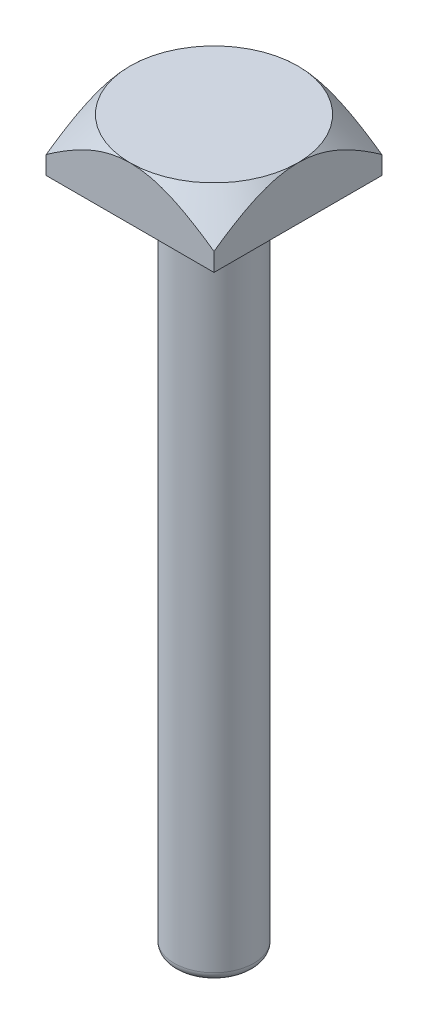
ISO-10303-21;
HEADER;
FILE_DESCRIPTION(('STEP AP214'),'2;1');
FILE_NAME('part.step','',(''),(''),'','','');
FILE_SCHEMA(('AUTOMOTIVE_DESIGN { 1 0 10303 214 1 1 1 1 }'));
ENDSEC;
DATA;
#1=APPLICATION_CONTEXT('core data for automotive mechanical design processes');
#2=APPLICATION_PROTOCOL_DEFINITION('international standard','automotive_design',2000,#1);
#3=PRODUCT_CONTEXT('',#1,'mechanical');
#4=PRODUCT('Part','Part','',(#3));
#5=PRODUCT_RELATED_PRODUCT_CATEGORY('part','',(#4));
#6=PRODUCT_DEFINITION_FORMATION('','',#4);
#7=PRODUCT_DEFINITION_CONTEXT('part definition',#1,'design');
#8=PRODUCT_DEFINITION('design','',#6,#7);
#9=PRODUCT_DEFINITION_SHAPE('','',#8);
#10=(LENGTH_UNIT() NAMED_UNIT(*) SI_UNIT(.MILLI.,.METRE.));
#11=(NAMED_UNIT(*) PLANE_ANGLE_UNIT() SI_UNIT($,.RADIAN.));
#12=(NAMED_UNIT(*) SI_UNIT($,.STERADIAN.) SOLID_ANGLE_UNIT());
#13=UNCERTAINTY_MEASURE_WITH_UNIT(LENGTH_MEASURE(1.E-05),#10,'distance_accuracy_value','');
#14=(GEOMETRIC_REPRESENTATION_CONTEXT(3) GLOBAL_UNCERTAINTY_ASSIGNED_CONTEXT((#13)) GLOBAL_UNIT_ASSIGNED_CONTEXT((#10,
#11,#12)) REPRESENTATION_CONTEXT('',''));
#15=CARTESIAN_POINT('',(0.,0.,0.));
#16=DIRECTION('',(0.,0.,1.));
#17=DIRECTION('',(1.,0.,0.));
#18=AXIS2_PLACEMENT_3D('',#15,#16,#17);
#19=CARTESIAN_POINT('',(14.,6.,-9.5));
#20=DIRECTION('',(-1.,0.,0.));
#21=DIRECTION('',(0.,-1.,0.));
#22=AXIS2_PLACEMENT_3D('',#19,#20,#21);
#23=PLANE('',#22);
#24=CARTESIAN_POINT('',(14.,-6.16599312174739,-19.4721662367495));
#25=CARTESIAN_POINT('',(14.,-5.76924661562535,-19.0306587695027));
#26=CARTESIAN_POINT('',(14.,-5.37387132656418,-18.5879083571048));
#27=CARTESIAN_POINT('',(14.,-4.58658874420138,-17.6992696729411));
#28=CARTESIAN_POINT('',(14.,-4.1946817472815,-17.253381138743));
#29=CARTESIAN_POINT('',(14.,-3.41378811833251,-16.3563487784739));
#30=CARTESIAN_POINT('',(14.,-3.02481616691146,-15.9051921518799));
#31=CARTESIAN_POINT('',(14.,-2.2522618562009,-14.9983091045179));
#32=CARTESIAN_POINT('',(14.,-1.86867929214896,-14.5425828584999));
#33=CARTESIAN_POINT('',(14.,-1.08671046568416,-13.5993558341223));
#34=CARTESIAN_POINT('',(14.,-0.688724142040345,-13.1115228122817));
#35=CARTESIAN_POINT('',(14.,0.0972631598394903,-12.127740391124));
#36=CARTESIAN_POINT('',(14.,0.485262999626204,-11.631790076894));
#37=CARTESIAN_POINT('',(14.,1.05674605712848,-10.8804316855481));
#38=CARTESIAN_POINT('',(14.,1.24535681621388,-10.6289221327915));
#39=CARTESIAN_POINT('',(14.,1.61855164136854,-10.122936754571));
#40=CARTESIAN_POINT('',(14.,1.80313581309921,-9.86846100721232));
#41=CARTESIAN_POINT('',(14.,2.16750299016799,-9.35616816236647));
#42=CARTESIAN_POINT('',(14.,2.34728697505086,-9.09835176278388));
#43=CARTESIAN_POINT('',(14.,2.7011558307242,-8.57884600167523));
#44=CARTESIAN_POINT('',(14.,2.87524104091076,-8.3171568721462));
#45=CARTESIAN_POINT('',(14.,3.17412721280475,-7.85493467103632));
#46=CARTESIAN_POINT('',(14.,3.30042278588939,-7.65536859867558));
#47=CARTESIAN_POINT('',(14.,3.54852838415979,-7.25345964461779));
#48=CARTESIAN_POINT('',(14.,3.67033839375831,-7.05111675327469));
#49=CARTESIAN_POINT('',(14.,3.90880250524161,-6.6432850603803));
#50=CARTESIAN_POINT('',(14.,4.02545427528355,-6.43779489145272));
#51=CARTESIAN_POINT('',(14.,4.25267855562839,-6.02347501374829));
#52=CARTESIAN_POINT('',(14.,4.36325111331347,-5.81464533101642));
#53=CARTESIAN_POINT('',(14.,4.5763702753258,-5.39518549248985));
#54=CARTESIAN_POINT('',(14.,4.67897827231214,-5.18458675025878));
#55=CARTESIAN_POINT('',(14.,4.87604292507633,-4.75961336071198));
#56=CARTESIAN_POINT('',(14.,4.97049886246233,-4.54523838261968));
#57=CARTESIAN_POINT('',(14.,5.23951493786688,-3.89645079968952));
#58=CARTESIAN_POINT('',(14.,5.39996433070188,-3.45591344527138));
#59=CARTESIAN_POINT('',(14.,5.61945387533872,-2.728720561896));
#60=CARTESIAN_POINT('',(14.,5.69391703568907,-2.44669896764991));
#61=CARTESIAN_POINT('',(14.,5.82020550087591,-1.8775836953198));
#62=CARTESIAN_POINT('',(14.,5.87203447212183,-1.59049084655016));
#63=CARTESIAN_POINT('',(14.,5.95031086354017,-1.01382091769355));
#64=CARTESIAN_POINT('',(14.,5.97684468254283,-0.724255727219075));
#65=CARTESIAN_POINT('',(14.,6.00333190102634,-0.143893334609149));
#66=CARTESIAN_POINT('',(14.,6.00328565264763,0.146903851153435));
#67=CARTESIAN_POINT('',(14.,5.97661898826888,0.727182792411846));
#68=CARTESIAN_POINT('',(14.,5.95000522827896,1.01666485913919));
#69=CARTESIAN_POINT('',(14.,5.87172266706753,1.59218947393448));
#70=CARTESIAN_POINT('',(14.,5.82005186094646,1.8782317448955));
#71=CARTESIAN_POINT('',(14.,5.69398182139449,2.44645150674143));
#72=CARTESIAN_POINT('',(14.,5.61948831039046,2.7286077957222));
#73=CARTESIAN_POINT('',(14.,5.45096162167953,3.28695252192376));
#74=CARTESIAN_POINT('',(14.,5.35692802815613,3.56314083200677));
#75=CARTESIAN_POINT('',(14.,5.12846275343973,4.17331443672115));
#76=CARTESIAN_POINT('',(14.,4.98972796682012,4.5056787747822));
#77=CARTESIAN_POINT('',(14.,4.69235694668232,5.16145646270299));
#78=CARTESIAN_POINT('',(14.,4.53371080916181,5.48486525963186));
#79=CARTESIAN_POINT('',(14.,4.20046369348786,6.12405309221409));
#80=CARTESIAN_POINT('',(14.,4.02583374948831,6.43981691033184));
#81=CARTESIAN_POINT('',(14.,3.66419592346179,7.06406092749921));
#82=CARTESIAN_POINT('',(14.,3.47718997307517,7.372542253047));
#83=CARTESIAN_POINT('',(14.,3.0905881318274,7.98758397010631));
#84=CARTESIAN_POINT('',(14.,2.89085164620449,8.29405557605348));
#85=CARTESIAN_POINT('',(14.,2.48322727117937,8.90152034753676));
#86=CARTESIAN_POINT('',(14.,2.27533913546706,9.20251334712844));
#87=CARTESIAN_POINT('',(14.,1.85319842359999,9.79947322763256));
#88=CARTESIAN_POINT('',(14.,1.63895342752225,10.0954454816737));
#89=CARTESIAN_POINT('',(14.,1.31353479882875,10.5363942636256));
#90=CARTESIAN_POINT('',(14.,1.20438826860106,10.6828735892338));
#91=CARTESIAN_POINT('',(14.,0.984861237266858,10.9749043216142));
#92=CARTESIAN_POINT('',(14.,0.874480738781644,11.1204557303566));
#93=CARTESIAN_POINT('',(14.,0.502857829512475,11.6065788078486));
#94=CARTESIAN_POINT('',(14.,0.23908003650954,11.9452145423811));
#95=CARTESIAN_POINT('',(14.,-0.293499267411837,12.6185179461384));
#96=CARTESIAN_POINT('',(14.,-0.562300944645748,12.9531854833945));
#97=CARTESIAN_POINT('',(14.,-1.10406440837471,13.6191953918572));
#98=CARTESIAN_POINT('',(14.,-1.37702666084492,13.9505373836148));
#99=CARTESIAN_POINT('',(14.,-1.92639427475781,14.6103569981068));
#100=CARTESIAN_POINT('',(14.,-2.20279967826907,14.9388345857604));
#101=CARTESIAN_POINT('',(14.,-3.03655492749339,15.9208680256002));
#102=CARTESIAN_POINT('',(14.,-3.59822433915991,16.5707566423306));
#103=CARTESIAN_POINT('',(14.,-4.72988826727741,17.8632445947826));
#104=CARTESIAN_POINT('',(14.,-5.29988298199509,18.5058437562566));
#105=CARTESIAN_POINT('',(14.,-6.16015613779992,19.4661895227683));
#106=CARTESIAN_POINT('',(14.,-6.44809215582441,19.7860389247611));
#107=CARTESIAN_POINT('',(14.,-7.02534099441635,20.4244852718829));
#108=CARTESIAN_POINT('',(14.,-7.3146537967991,20.7430822334532));
#109=CARTESIAN_POINT('',(14.,-8.18441294934065,21.6972341083258));
#110=CARTESIAN_POINT('',(14.,-8.76666993824811,22.331138754053));
#111=CARTESIAN_POINT('',(14.,-9.93480434540045,23.5952866023794));
#112=CARTESIAN_POINT('',(14.,-10.5206807610836,24.2255307326568));
#113=CARTESIAN_POINT('',(14.,-11.6954539407981,25.4831907617642));
#114=CARTESIAN_POINT('',(14.,-12.2843506913249,26.1106066732165));
#115=CARTESIAN_POINT('',(14.,-13.915765429,27.8419604615082));
#116=CARTESIAN_POINT('',(14.,-14.9608613497955,28.943468643821));
#117=CARTESIAN_POINT('',(14.,-17.0565397456754,31.141411657545));
#118=CARTESIAN_POINT('',(14.,-18.1071226479951,32.2378460809715));
#119=CARTESIAN_POINT('',(14.,-20.2085305908091,34.422935382294));
#120=CARTESIAN_POINT('',(14.,-21.259341289616,35.5116040585265));
#121=CARTESIAN_POINT('',(14.,-22.8377863728211,37.1423530459074));
#122=CARTESIAN_POINT('',(14.,-23.364282541177,37.685536023142));
#123=CARTESIAN_POINT('',(14.,-24.4179478782102,38.7712480437648));
#124=CARTESIAN_POINT('',(14.,-24.9451170463559,39.3137770876691));
#125=CARTESIAN_POINT('',(14.,-25.4725803158543,39.8560200940728));
#126=B_SPLINE_CURVE_WITH_KNOTS('',3,(#24,#25,#26,#27,#28,#29,#30,#31,#32,#33,#34,#35,#36,#37,
#38,#39,#40,#41,#42,#43,#44,#45,#46,#47,#48,#49,#50,#51,#52,#53,#54,#55,#56,#57,#58,#59,#60,#61,
#62,#63,#64,#65,#66,#67,#68,#69,#70,#71,#72,#73,#74,#75,#76,#77,#78,#79,#80,#81,#82,#83,#84,#85,
#86,#87,#88,#89,#90,#91,#92,#93,#94,#95,#96,#97,#98,#99,#100,#101,#102,#103,#104,#105,#106,#107,
#108,#109,#110,#111,#112,#113,#114,#115,#116,#117,#118,#119,#120,#121,#122,#123,#124,#125),
.UNSPECIFIED.,.F.,.F.,(4,2,2,2,2,2,2,2,2,2,2,2,2,2,2,2,2,2,2,2,2,2,2,2,2,2,2,2,2,2,2,2,2,2,2,2,
2,2,2,2,2,2,2,2,2,2,2,2,2,2,4),(0.,1.78074761237893,3.56164595638184,5.34866960208709,
7.13562516766089,9.02428194412703,10.9131530804465,11.8562440497432,12.79931024161,
13.7421824936468,14.6849984894655,15.3934646958844,16.1019333639782,16.8107190961481,
17.5194993031653,18.2221205431093,18.924803637738,20.3286104925706,21.2029126115842,
22.0770730537911,22.9482368766244,23.8193891580274,24.6903232427228,25.56132702532,
26.4359784620459,27.310648513419,28.3902662284354,29.4704230947187,30.5525777140306,
31.6345638277741,32.7318437278412,33.8291568088815,34.9252102189652,35.4732217899652,
36.0212321970542,37.3089067072438,38.5966239216145,39.8844864329023,41.1723646948232,
43.7491600472681,46.3260168663584,47.6170970917041,48.9081603114159,51.4903321359388,
54.0718182004839,56.6532927326967,61.2084706948621,65.7640087900169,70.3032321093256,
72.5726399093185,74.8420459175794),.UNSPECIFIED.);
#127=CARTESIAN_POINT('',(14.,2.06497115745561,9.5));
#128=VERTEX_POINT('',#127);
#129=CARTESIAN_POINT('',(14.,6.,0.));
#130=VERTEX_POINT('',#129);
#131=EDGE_CURVE('E85',#128,#130,#126,.F.);
#132=ORIENTED_EDGE('',*,*,#131,.F.);
#133=DIRECTION('',(0.,-1.,0.));
#134=VECTOR('',#133,1.);
#135=CARTESIAN_POINT('',(14.,6.,9.5));
#136=LINE('',#135,#134);
#137=CARTESIAN_POINT('',(14.,0.,9.5));
#138=VERTEX_POINT('',#137);
#139=EDGE_CURVE('E204',#128,#138,#136,.T.);
#140=ORIENTED_EDGE('',*,*,#139,.T.);
#141=DIRECTION('',(0.,0.,-1.));
#142=VECTOR('',#141,1.);
#143=CARTESIAN_POINT('',(14.,0.,-9.5));
#144=LINE('',#143,#142);
#145=CARTESIAN_POINT('',(14.,0.,-9.5));
#146=VERTEX_POINT('',#145);
#147=EDGE_CURVE('E93',#138,#146,#144,.T.);
#148=ORIENTED_EDGE('',*,*,#147,.T.);
#149=DIRECTION('',(0.,-1.,0.));
#150=VECTOR('',#149,1.);
#151=CARTESIAN_POINT('',(14.,6.,-9.5));
#152=LINE('',#151,#150);
#153=CARTESIAN_POINT('',(14.,2.06497115745561,-9.5));
#154=VERTEX_POINT('',#153);
#155=EDGE_CURVE('E106',#154,#146,#152,.T.);
#156=ORIENTED_EDGE('',*,*,#155,.F.);
#157=EDGE_CURVE('E94',#130,#154,#126,.F.);
#158=ORIENTED_EDGE('',*,*,#157,.F.);
#159=EDGE_LOOP('',(#132,#140,#148,#156,#158));
#160=FACE_BOUND('',#159,.T.);
#161=ADVANCED_FACE('F33',(#160),#23,.F.);
#162=CARTESIAN_POINT('',(-5.,6.,-9.5));
#163=DIRECTION('',(0.,0.,1.));
#164=DIRECTION('',(1.,0.,0.));
#165=AXIS2_PLACEMENT_3D('',#162,#163,#164);
#166=PLANE('',#165);
#167=CARTESIAN_POINT('',(-14.9721662367495,-6.16599312174739,-9.5));
#168=CARTESIAN_POINT('',(-14.5306587695027,-5.76924661562536,-9.5));
#169=CARTESIAN_POINT('',(-14.0879083571048,-5.37387132656419,-9.5));
#170=CARTESIAN_POINT('',(-13.1992696729411,-4.58658874420138,-9.5));
#171=CARTESIAN_POINT('',(-12.753381138743,-4.19468174728151,-9.5));
#172=CARTESIAN_POINT('',(-11.8563487784739,-3.41378811833251,-9.5));
#173=CARTESIAN_POINT('',(-11.4051921518799,-3.02481616691147,-9.5));
#174=CARTESIAN_POINT('',(-10.4983091045179,-2.2522618562009,-9.5));
#175=CARTESIAN_POINT('',(-10.0425828584999,-1.86867929214896,-9.5));
#176=CARTESIAN_POINT('',(-9.09935583412229,-1.08671046568416,-9.5));
#177=CARTESIAN_POINT('',(-8.61152281228167,-0.688724142040343,-9.5));
#178=CARTESIAN_POINT('',(-7.62774039112404,0.0972631598394937,-9.5));
#179=CARTESIAN_POINT('',(-7.13179007689398,0.485262999626205,-9.5));
#180=CARTESIAN_POINT('',(-6.38043168554806,1.05674605712848,-9.5));
#181=CARTESIAN_POINT('',(-6.12892213279148,1.24535681621388,-9.5));
#182=CARTESIAN_POINT('',(-5.62293675457099,1.61855164136854,-9.5));
#183=CARTESIAN_POINT('',(-5.36846100721232,1.80313581309921,-9.5));
#184=CARTESIAN_POINT('',(-4.85616816236647,2.16750299016799,-9.5));
#185=CARTESIAN_POINT('',(-4.59835176278388,2.34728697505086,-9.5));
#186=CARTESIAN_POINT('',(-4.07884600167524,2.7011558307242,-9.5));
#187=CARTESIAN_POINT('',(-3.8171568721462,2.87524104091076,-9.5));
#188=CARTESIAN_POINT('',(-3.35493467103633,3.17412721280475,-9.5));
#189=CARTESIAN_POINT('',(-3.15536859867559,3.30042278588938,-9.5));
#190=CARTESIAN_POINT('',(-2.7534596446178,3.54852838415979,-9.5));
#191=CARTESIAN_POINT('',(-2.5511167532747,3.67033839375831,-9.5));
#192=CARTESIAN_POINT('',(-2.1432850603803,3.90880250524161,-9.5));
#193=CARTESIAN_POINT('',(-1.93779489145273,4.02545427528355,-9.5));
#194=CARTESIAN_POINT('',(-1.52347501374829,4.25267855562839,-9.5));
#195=CARTESIAN_POINT('',(-1.31464533101643,4.36325111331346,-9.5));
#196=CARTESIAN_POINT('',(-0.895185492489855,4.5763702753258,-9.5));
#197=CARTESIAN_POINT('',(-0.684586750258783,4.67897827231214,-9.5));
#198=CARTESIAN_POINT('',(-0.259613360711981,4.87604292507633,-9.5));
#199=CARTESIAN_POINT('',(-0.0452383826196874,4.97049886246232,-9.5));
#200=CARTESIAN_POINT('',(0.603549200310475,5.23951493786688,-9.5));
#201=CARTESIAN_POINT('',(1.04408655472862,5.39996433070188,-9.5));
#202=CARTESIAN_POINT('',(1.771279438104,5.61945387533872,-9.5));
#203=CARTESIAN_POINT('',(2.05330103235008,5.69391703568907,-9.5));
#204=CARTESIAN_POINT('',(2.62241630468019,5.8202055008759,-9.5));
#205=CARTESIAN_POINT('',(2.90950915344984,5.87203447212183,-9.5));
#206=CARTESIAN_POINT('',(3.48617908230645,5.95031086354017,-9.5));
#207=CARTESIAN_POINT('',(3.77574427278092,5.97684468254283,-9.5));
#208=CARTESIAN_POINT('',(4.35610666539085,6.00333190102634,-9.5));
#209=CARTESIAN_POINT('',(4.64690385115343,6.00328565264763,-9.5));
#210=CARTESIAN_POINT('',(5.22718279241184,5.97661898826888,-9.5));
#211=CARTESIAN_POINT('',(5.51666485913918,5.95000522827896,-9.5));
#212=CARTESIAN_POINT('',(6.09218947393447,5.87172266706753,-9.5));
#213=CARTESIAN_POINT('',(6.37823174489549,5.82005186094646,-9.5));
#214=CARTESIAN_POINT('',(6.94645150674143,5.69398182139449,-9.5));
#215=CARTESIAN_POINT('',(7.2286077957222,5.61948831039046,-9.5));
#216=CARTESIAN_POINT('',(7.78695252192375,5.45096162167953,-9.5));
#217=CARTESIAN_POINT('',(8.06314083200677,5.35692802815614,-9.5));
#218=CARTESIAN_POINT('',(8.67331443672115,5.12846275343973,-9.5));
#219=CARTESIAN_POINT('',(9.0056787747822,4.98972796682012,-9.5));
#220=CARTESIAN_POINT('',(9.66145646270298,4.69235694668232,-9.5));
#221=CARTESIAN_POINT('',(9.98486525963186,4.53371080916181,-9.5));
#222=CARTESIAN_POINT('',(10.6240530922141,4.20046369348787,-9.5));
#223=CARTESIAN_POINT('',(10.9398169103318,4.02583374948831,-9.5));
#224=CARTESIAN_POINT('',(11.5640609274992,3.66419592346179,-9.5));
#225=CARTESIAN_POINT('',(11.872542253047,3.47718997307517,-9.5));
#226=CARTESIAN_POINT('',(12.4875839701063,3.0905881318274,-9.5));
#227=CARTESIAN_POINT('',(12.7940555760535,2.8908516462045,-9.5));
#228=CARTESIAN_POINT('',(13.4015203475367,2.48322727117937,-9.5));
#229=CARTESIAN_POINT('',(13.7025133471284,2.27533913546707,-9.5));
#230=CARTESIAN_POINT('',(14.2994732276326,1.8531984236,-9.5));
#231=CARTESIAN_POINT('',(14.5954454816737,1.63895342752225,-9.5));
#232=CARTESIAN_POINT('',(15.0363942636256,1.31353479882876,-9.5));
#233=CARTESIAN_POINT('',(15.1828735892338,1.20438826860107,-9.5));
#234=CARTESIAN_POINT('',(15.4749043216142,0.984861237266867,-9.5));
#235=CARTESIAN_POINT('',(15.6204557303566,0.874480738781655,-9.5));
#236=CARTESIAN_POINT('',(16.1065788078486,0.502857829512486,-9.5));
#237=CARTESIAN_POINT('',(16.4452145423811,0.23908003650955,-9.5));
#238=CARTESIAN_POINT('',(17.1185179461384,-0.293499267411828,-9.5));
#239=CARTESIAN_POINT('',(17.4531854833945,-0.562300944645738,-9.5));
#240=CARTESIAN_POINT('',(18.1191953918572,-1.1040644083747,-9.5));
#241=CARTESIAN_POINT('',(18.4505373836147,-1.37702666084491,-9.5));
#242=CARTESIAN_POINT('',(19.1103569981068,-1.9263942747578,-9.5));
#243=CARTESIAN_POINT('',(19.4388345857604,-2.20279967826906,-9.5));
#244=CARTESIAN_POINT('',(20.4208680256002,-3.03655492749337,-9.5));
#245=CARTESIAN_POINT('',(21.0707566423306,-3.5982243391599,-9.5));
#246=CARTESIAN_POINT('',(22.3632445947826,-4.7298882672774,-9.5));
#247=CARTESIAN_POINT('',(23.0058437562566,-5.29988298199508,-9.5));
#248=CARTESIAN_POINT('',(23.9661895227683,-6.1601561377999,-9.5));
#249=CARTESIAN_POINT('',(24.2860389247611,-6.44809215582439,-9.5));
#250=CARTESIAN_POINT('',(24.9244852718828,-7.02534099441633,-9.5));
#251=CARTESIAN_POINT('',(25.2430822334532,-7.31465379679908,-9.5));
#252=CARTESIAN_POINT('',(26.1972341083258,-8.18441294934062,-9.5));
#253=CARTESIAN_POINT('',(26.8311387540529,-8.76666993824809,-9.5));
#254=CARTESIAN_POINT('',(28.0952866023794,-9.93480434540042,-9.5));
#255=CARTESIAN_POINT('',(28.7255307326567,-10.5206807610836,-9.5));
#256=CARTESIAN_POINT('',(29.9831907617642,-11.6954539407981,-9.5));
#257=CARTESIAN_POINT('',(30.6106066732164,-12.2843506913249,-9.5));
#258=CARTESIAN_POINT('',(32.3419604615082,-13.915765429,-9.5));
#259=CARTESIAN_POINT('',(33.4434686438209,-14.9608613497954,-9.5));
#260=CARTESIAN_POINT('',(35.641411657545,-17.0565397456753,-9.5));
#261=CARTESIAN_POINT('',(36.7378460809715,-18.1071226479951,-9.5));
#262=CARTESIAN_POINT('',(38.922935382294,-20.2085305908091,-9.5));
#263=CARTESIAN_POINT('',(40.0116040585264,-21.259341289616,-9.5));
#264=CARTESIAN_POINT('',(41.6423530459074,-22.8377863728211,-9.5));
#265=CARTESIAN_POINT('',(42.1855360231419,-23.364282541177,-9.5));
#266=CARTESIAN_POINT('',(43.2712480437648,-24.4179478782102,-9.5));
#267=CARTESIAN_POINT('',(43.8137770876691,-24.9451170463558,-9.5));
#268=CARTESIAN_POINT('',(44.3560200940728,-25.4725803158543,-9.5));
#269=B_SPLINE_CURVE_WITH_KNOTS('',3,(#167,#168,#169,#170,#171,#172,#173,#174,#175,#176,#177,
#178,#179,#180,#181,#182,#183,#184,#185,#186,#187,#188,#189,#190,#191,#192,#193,#194,#195,#196,
#197,#198,#199,#200,#201,#202,#203,#204,#205,#206,#207,#208,#209,#210,#211,#212,#213,#214,#215,
#216,#217,#218,#219,#220,#221,#222,#223,#224,#225,#226,#227,#228,#229,#230,#231,#232,#233,#234,
#235,#236,#237,#238,#239,#240,#241,#242,#243,#244,#245,#246,#247,#248,#249,#250,#251,#252,#253,
#254,#255,#256,#257,#258,#259,#260,#261,#262,#263,#264,#265,#266,#267,#268),.UNSPECIFIED.,.F.,
.F.,(4,2,2,2,2,2,2,2,2,2,2,2,2,2,2,2,2,2,2,2,2,2,2,2,2,2,2,2,2,2,2,2,2,2,2,2,2,2,2,2,2,2,2,2,2,
2,2,2,2,2,4),(0.,1.78074761237893,3.56164595638184,5.3486696020871,7.1356251676609,
9.02428194412704,10.9131530804465,11.8562440497432,12.79931024161,13.7421824936468,
14.6849984894656,15.3934646958844,16.1019333639782,16.8107190961481,17.5194993031653,
18.2221205431093,18.924803637738,20.3286104925706,21.2029126115842,22.0770730537911,
22.9482368766244,23.8193891580274,24.6903232427228,25.56132702532,26.4359784620459,
27.310648513419,28.3902662284354,29.4704230947187,30.5525777140306,31.6345638277741,
32.7318437278412,33.8291568088815,34.9252102189652,35.4732217899652,36.0212321970542,
37.3089067072438,38.5966239216145,39.8844864329023,41.1723646948232,43.749160047268,
46.3260168663584,47.6170970917041,48.9081603114159,51.4903321359387,54.0718182004839,
56.6532927326966,61.208470694862,65.7640087900168,70.3032321093256,72.5726399093185,
74.8420459175794),.UNSPECIFIED.);
#270=CARTESIAN_POINT('',(4.5,6.,-9.5));
#271=VERTEX_POINT('',#270);
#272=EDGE_CURVE('E100',#154,#271,#269,.F.);
#273=ORIENTED_EDGE('',*,*,#272,.F.);
#274=ORIENTED_EDGE('',*,*,#155,.T.);
#275=DIRECTION('',(-1.,0.,0.));
#276=VECTOR('',#275,1.);
#277=CARTESIAN_POINT('',(-5.,0.,-9.5));
#278=LINE('',#277,#276);
#279=CARTESIAN_POINT('',(-5.,0.,-9.5));
#280=VERTEX_POINT('',#279);
#281=EDGE_CURVE('E202',#146,#280,#278,.T.);
#282=ORIENTED_EDGE('',*,*,#281,.T.);
#283=DIRECTION('',(0.,-1.,0.));
#284=VECTOR('',#283,1.);
#285=CARTESIAN_POINT('',(-5.,6.,-9.5));
#286=LINE('',#285,#284);
#287=CARTESIAN_POINT('',(-5.,2.06497115745561,-9.5));
#288=VERTEX_POINT('',#287);
#289=EDGE_CURVE('E154',#288,#280,#286,.T.);
#290=ORIENTED_EDGE('',*,*,#289,.F.);
#291=EDGE_CURVE('E107',#271,#288,#269,.F.);
#292=ORIENTED_EDGE('',*,*,#291,.F.);
#293=EDGE_LOOP('',(#273,#274,#282,#290,#292));
#294=FACE_BOUND('',#293,.T.);
#295=ADVANCED_FACE('F126',(#294),#166,.F.);
#296=CARTESIAN_POINT('',(-5.,6.,-9.5));
#297=DIRECTION('',(1.,0.,0.));
#298=DIRECTION('',(0.,0.,-1.));
#299=AXIS2_PLACEMENT_3D('',#296,#297,#298);
#300=PLANE('',#299);
#301=CARTESIAN_POINT('',(-5.,-6.16599312174739,-19.4721662367495));
#302=CARTESIAN_POINT('',(-5.,-5.76924661562535,-19.0306587695027));
#303=CARTESIAN_POINT('',(-5.,-5.37387132656418,-18.5879083571048));
#304=CARTESIAN_POINT('',(-5.,-4.58658874420138,-17.6992696729411));
#305=CARTESIAN_POINT('',(-5.,-4.19468174728151,-17.253381138743));
#306=CARTESIAN_POINT('',(-5.,-3.41378811833251,-16.3563487784739));
#307=CARTESIAN_POINT('',(-5.,-3.02481616691147,-15.9051921518799));
#308=CARTESIAN_POINT('',(-5.,-2.2522618562009,-14.9983091045179));
#309=CARTESIAN_POINT('',(-5.,-1.86867929214896,-14.5425828584999));
#310=CARTESIAN_POINT('',(-5.,-1.08671046568416,-13.5993558341223));
#311=CARTESIAN_POINT('',(-5.,-0.688724142040346,-13.1115228122817));
#312=CARTESIAN_POINT('',(-5.,0.0972631598394908,-12.127740391124));
#313=CARTESIAN_POINT('',(-5.,0.485262999626206,-11.631790076894));
#314=CARTESIAN_POINT('',(-5.,1.05674605712848,-10.8804316855481));
#315=CARTESIAN_POINT('',(-5.,1.24535681621388,-10.6289221327915));
#316=CARTESIAN_POINT('',(-5.,1.61855164136854,-10.122936754571));
#317=CARTESIAN_POINT('',(-5.,1.80313581309921,-9.86846100721232));
#318=CARTESIAN_POINT('',(-5.,2.16750299016799,-9.35616816236647));
#319=CARTESIAN_POINT('',(-5.,2.34728697505086,-9.09835176278388));
#320=CARTESIAN_POINT('',(-5.,2.7011558307242,-8.57884600167523));
#321=CARTESIAN_POINT('',(-5.,2.87524104091076,-8.31715687214619));
#322=CARTESIAN_POINT('',(-5.,3.17412721280475,-7.85493467103632));
#323=CARTESIAN_POINT('',(-5.,3.30042278588938,-7.65536859867558));
#324=CARTESIAN_POINT('',(-5.,3.54852838415979,-7.25345964461779));
#325=CARTESIAN_POINT('',(-5.,3.67033839375831,-7.05111675327469));
#326=CARTESIAN_POINT('',(-5.,3.90880250524161,-6.6432850603803));
#327=CARTESIAN_POINT('',(-5.,4.02545427528355,-6.43779489145272));
#328=CARTESIAN_POINT('',(-5.,4.25267855562839,-6.02347501374828));
#329=CARTESIAN_POINT('',(-5.,4.36325111331346,-5.81464533101642));
#330=CARTESIAN_POINT('',(-5.,4.5763702753258,-5.39518549248985));
#331=CARTESIAN_POINT('',(-5.,4.67897827231214,-5.18458675025878));
#332=CARTESIAN_POINT('',(-5.,4.87604292507633,-4.75961336071198));
#333=CARTESIAN_POINT('',(-5.,4.97049886246232,-4.54523838261968));
#334=CARTESIAN_POINT('',(-5.,5.23951493786687,-3.89645079968952));
#335=CARTESIAN_POINT('',(-5.,5.39996433070188,-3.45591344527137));
#336=CARTESIAN_POINT('',(-5.,5.61945387533872,-2.728720561896));
#337=CARTESIAN_POINT('',(-5.,5.69391703568907,-2.44669896764991));
#338=CARTESIAN_POINT('',(-5.,5.8202055008759,-1.8775836953198));
#339=CARTESIAN_POINT('',(-5.,5.87203447212183,-1.59049084655016));
#340=CARTESIAN_POINT('',(-5.,5.95031086354017,-1.01382091769355));
#341=CARTESIAN_POINT('',(-5.,5.97684468254282,-0.724255727219075));
#342=CARTESIAN_POINT('',(-5.,6.00333190102634,-0.14389333460915));
#343=CARTESIAN_POINT('',(-5.,6.00328565264763,0.146903851153434));
#344=CARTESIAN_POINT('',(-5.,5.97661898826888,0.727182792411844));
#345=CARTESIAN_POINT('',(-5.,5.95000522827896,1.01666485913918));
#346=CARTESIAN_POINT('',(-5.,5.87172266706753,1.59218947393448));
#347=CARTESIAN_POINT('',(-5.,5.82005186094646,1.8782317448955));
#348=CARTESIAN_POINT('',(-5.,5.69398182139449,2.44645150674143));
#349=CARTESIAN_POINT('',(-5.,5.61948831039046,2.7286077957222));
#350=CARTESIAN_POINT('',(-5.,5.45096162167953,3.28695252192376));
#351=CARTESIAN_POINT('',(-5.,5.35692802815613,3.56314083200677));
#352=CARTESIAN_POINT('',(-5.,5.12846275343973,4.17331443672115));
#353=CARTESIAN_POINT('',(-5.,4.98972796682012,4.5056787747822));
#354=CARTESIAN_POINT('',(-5.,4.69235694668232,5.16145646270299));
#355=CARTESIAN_POINT('',(-5.,4.53371080916181,5.48486525963186));
#356=CARTESIAN_POINT('',(-5.,4.20046369348787,6.12405309221408));
#357=CARTESIAN_POINT('',(-5.,4.02583374948831,6.43981691033183));
#358=CARTESIAN_POINT('',(-5.,3.6641959234618,7.06406092749921));
#359=CARTESIAN_POINT('',(-5.,3.47718997307517,7.372542253047));
#360=CARTESIAN_POINT('',(-5.,3.0905881318274,7.9875839701063));
#361=CARTESIAN_POINT('',(-5.,2.8908516462045,8.29405557605347));
#362=CARTESIAN_POINT('',(-5.,2.48322727117937,8.90152034753675));
#363=CARTESIAN_POINT('',(-5.,2.27533913546707,9.20251334712843));
#364=CARTESIAN_POINT('',(-5.,1.8531984236,9.79947322763255));
#365=CARTESIAN_POINT('',(-5.,1.63895342752226,10.0954454816737));
#366=CARTESIAN_POINT('',(-5.,1.31353479882876,10.5363942636256));
#367=CARTESIAN_POINT('',(-5.,1.20438826860107,10.6828735892338));
#368=CARTESIAN_POINT('',(-5.,0.984861237266872,10.9749043216142));
#369=CARTESIAN_POINT('',(-5.,0.874480738781659,11.1204557303566));
#370=CARTESIAN_POINT('',(-5.,0.502857829512489,11.6065788078486));
#371=CARTESIAN_POINT('',(-5.,0.239080036509554,11.9452145423811));
#372=CARTESIAN_POINT('',(-5.,-0.293499267411822,12.6185179461384));
#373=CARTESIAN_POINT('',(-5.,-0.562300944645731,12.9531854833945));
#374=CARTESIAN_POINT('',(-5.,-1.10406440837469,13.6191953918572));
#375=CARTESIAN_POINT('',(-5.,-1.37702666084491,13.9505373836147));
#376=CARTESIAN_POINT('',(-5.,-1.92639427475779,14.6103569981068));
#377=CARTESIAN_POINT('',(-5.,-2.20279967826905,14.9388345857604));
#378=CARTESIAN_POINT('',(-5.,-3.03655492749337,15.9208680256002));
#379=CARTESIAN_POINT('',(-5.,-3.59822433915989,16.5707566423306));
#380=CARTESIAN_POINT('',(-5.,-4.72988826727739,17.8632445947826));
#381=CARTESIAN_POINT('',(-5.,-5.29988298199508,18.5058437562566));
#382=CARTESIAN_POINT('',(-5.,-6.1601561377999,19.4661895227683));
#383=CARTESIAN_POINT('',(-5.,-6.44809215582439,19.7860389247611));
#384=CARTESIAN_POINT('',(-5.,-7.02534099441632,20.4244852718828));
#385=CARTESIAN_POINT('',(-5.,-7.31465379679908,20.7430822334532));
#386=CARTESIAN_POINT('',(-5.,-8.18441294934062,21.6972341083258));
#387=CARTESIAN_POINT('',(-5.,-8.76666993824809,22.3311387540529));
#388=CARTESIAN_POINT('',(-5.,-9.93480434540042,23.5952866023794));
#389=CARTESIAN_POINT('',(-5.,-10.5206807610836,24.2255307326567));
#390=CARTESIAN_POINT('',(-5.,-11.6954539407981,25.4831907617642));
#391=CARTESIAN_POINT('',(-5.,-12.2843506913249,26.1106066732164));
#392=CARTESIAN_POINT('',(-5.,-13.915765429,27.8419604615082));
#393=CARTESIAN_POINT('',(-5.,-14.9608613497954,28.9434686438209));
#394=CARTESIAN_POINT('',(-5.,-17.0565397456753,31.141411657545));
#395=CARTESIAN_POINT('',(-4.99999999999999,-18.1071226479951,32.2378460809715));
#396=CARTESIAN_POINT('',(-4.99999999999999,-20.208530590809,34.422935382294));
#397=CARTESIAN_POINT('',(-4.99999999999999,-21.259341289616,35.5116040585264));
#398=CARTESIAN_POINT('',(-4.99999999999999,-22.8377863728211,37.1423530459074));
#399=CARTESIAN_POINT('',(-4.99999999999999,-23.364282541177,37.6855360231419));
#400=CARTESIAN_POINT('',(-4.99999999999999,-24.4179478782102,38.7712480437648));
#401=CARTESIAN_POINT('',(-4.99999999999999,-24.9451170463558,39.313777087669));
#402=CARTESIAN_POINT('',(-4.99999999999999,-25.4725803158543,39.8560200940728));
#403=B_SPLINE_CURVE_WITH_KNOTS('',3,(#301,#302,#303,#304,#305,#306,#307,#308,#309,#310,#311,
#312,#313,#314,#315,#316,#317,#318,#319,#320,#321,#322,#323,#324,#325,#326,#327,#328,#329,#330,
#331,#332,#333,#334,#335,#336,#337,#338,#339,#340,#341,#342,#343,#344,#345,#346,#347,#348,#349,
#350,#351,#352,#353,#354,#355,#356,#357,#358,#359,#360,#361,#362,#363,#364,#365,#366,#367,#368,
#369,#370,#371,#372,#373,#374,#375,#376,#377,#378,#379,#380,#381,#382,#383,#384,#385,#386,#387,
#388,#389,#390,#391,#392,#393,#394,#395,#396,#397,#398,#399,#400,#401,#402),.UNSPECIFIED.,.F.,
.F.,(4,2,2,2,2,2,2,2,2,2,2,2,2,2,2,2,2,2,2,2,2,2,2,2,2,2,2,2,2,2,2,2,2,2,2,2,2,2,2,2,2,2,2,2,2,
2,2,2,2,2,4),(0.,1.78074761237893,3.56164595638184,5.34866960208709,7.13562516766089,
9.02428194412704,10.9131530804465,11.8562440497432,12.79931024161,13.7421824936468,
14.6849984894656,15.3934646958844,16.1019333639782,16.8107190961481,17.5194993031654,
18.2221205431093,18.924803637738,20.3286104925706,21.2029126115842,22.0770730537911,
22.9482368766244,23.8193891580274,24.6903232427228,25.56132702532,26.4359784620459,
27.310648513419,28.3902662284354,29.4704230947187,30.5525777140306,31.634563827774,
32.7318437278412,33.8291568088814,34.9252102189652,35.4732217899652,36.0212321970542,
37.3089067072438,38.5966239216145,39.8844864329023,41.1723646948232,43.749160047268,
46.3260168663584,47.6170970917041,48.9081603114159,51.4903321359387,54.0718182004839,
56.6532927326966,61.208470694862,65.7640087900168,70.3032321093256,72.5726399093185,
74.8420459175794),.UNSPECIFIED.);
#404=CARTESIAN_POINT('',(-5.,6.,0.));
#405=VERTEX_POINT('',#404);
#406=EDGE_CURVE('E165',#288,#405,#403,.T.);
#407=ORIENTED_EDGE('',*,*,#406,.F.);
#408=ORIENTED_EDGE('',*,*,#289,.T.);
#409=DIRECTION('',(0.,0.,1.));
#410=VECTOR('',#409,1.);
#411=CARTESIAN_POINT('',(-5.,0.,-9.5));
#412=LINE('',#411,#410);
#413=CARTESIAN_POINT('',(-5.,0.,9.5));
#414=VERTEX_POINT('',#413);
#415=EDGE_CURVE('E211',#280,#414,#412,.T.);
#416=ORIENTED_EDGE('',*,*,#415,.T.);
#417=DIRECTION('',(0.,-1.,0.));
#418=VECTOR('',#417,1.);
#419=CARTESIAN_POINT('',(-5.,6.,9.5));
#420=LINE('',#419,#418);
#421=CARTESIAN_POINT('',(-5.,2.06497115745561,9.5));
#422=VERTEX_POINT('',#421);
#423=EDGE_CURVE('E168',#422,#414,#420,.T.);
#424=ORIENTED_EDGE('',*,*,#423,.F.);
#425=EDGE_CURVE('E164',#405,#422,#403,.T.);
#426=ORIENTED_EDGE('',*,*,#425,.F.);
#427=EDGE_LOOP('',(#407,#408,#416,#424,#426));
#428=FACE_BOUND('',#427,.T.);
#429=ADVANCED_FACE('F140',(#428),#300,.F.);
#430=CARTESIAN_POINT('',(-5.,6.,9.5));
#431=DIRECTION('',(0.,0.,-1.));
#432=DIRECTION('',(-1.,0.,0.));
#433=AXIS2_PLACEMENT_3D('',#430,#431,#432);
#434=PLANE('',#433);
#435=CARTESIAN_POINT('',(-14.9721662367495,-6.16599312174739,9.5));
#436=CARTESIAN_POINT('',(-14.5306587695027,-5.76924661562535,9.5));
#437=CARTESIAN_POINT('',(-14.0879083571048,-5.37387132656418,9.5));
#438=CARTESIAN_POINT('',(-13.1992696729411,-4.58658874420138,9.5));
#439=CARTESIAN_POINT('',(-12.753381138743,-4.19468174728151,9.5));
#440=CARTESIAN_POINT('',(-11.8563487784739,-3.41378811833251,9.5));
#441=CARTESIAN_POINT('',(-11.4051921518799,-3.02481616691147,9.5));
#442=CARTESIAN_POINT('',(-10.4983091045179,-2.25226185620091,9.5));
#443=CARTESIAN_POINT('',(-10.0425828584999,-1.86867929214896,9.5));
#444=CARTESIAN_POINT('',(-9.0993558341223,-1.08671046568416,9.5));
#445=CARTESIAN_POINT('',(-8.61152281228168,-0.688724142040347,9.5));
#446=CARTESIAN_POINT('',(-7.62774039112404,0.0972631598394883,9.5));
#447=CARTESIAN_POINT('',(-7.13179007689398,0.485262999626201,9.5));
#448=CARTESIAN_POINT('',(-6.38043168554807,1.05674605712848,9.5));
#449=CARTESIAN_POINT('',(-6.12892213279148,1.24535681621388,9.5));
#450=CARTESIAN_POINT('',(-5.622936754571,1.61855164136854,9.5));
#451=CARTESIAN_POINT('',(-5.36846100721232,1.80313581309921,9.5));
#452=CARTESIAN_POINT('',(-4.85616816236647,2.16750299016799,9.5));
#453=CARTESIAN_POINT('',(-4.59835176278389,2.34728697505086,9.5));
#454=CARTESIAN_POINT('',(-4.07884600167524,2.7011558307242,9.5));
#455=CARTESIAN_POINT('',(-3.8171568721462,2.87524104091076,9.5));
#456=CARTESIAN_POINT('',(-3.35493467103633,3.17412721280475,9.5));
#457=CARTESIAN_POINT('',(-3.15536859867559,3.30042278588938,9.5));
#458=CARTESIAN_POINT('',(-2.75345964461779,3.54852838415979,9.5));
#459=CARTESIAN_POINT('',(-2.5511167532747,3.67033839375831,9.5));
#460=CARTESIAN_POINT('',(-2.1432850603803,3.90880250524161,9.5));
#461=CARTESIAN_POINT('',(-1.93779489145272,4.02545427528355,9.5));
#462=CARTESIAN_POINT('',(-1.52347501374829,4.25267855562839,9.5));
#463=CARTESIAN_POINT('',(-1.31464533101643,4.36325111331347,9.5));
#464=CARTESIAN_POINT('',(-0.895185492489852,4.5763702753258,9.5));
#465=CARTESIAN_POINT('',(-0.684586750258781,4.67897827231214,9.5));
#466=CARTESIAN_POINT('',(-0.25961336071198,4.87604292507633,9.5));
#467=CARTESIAN_POINT('',(-0.0452383826196842,4.97049886246233,9.5));
#468=CARTESIAN_POINT('',(0.603549200310479,5.23951493786688,9.5));
#469=CARTESIAN_POINT('',(1.04408655472862,5.39996433070188,9.5));
#470=CARTESIAN_POINT('',(1.771279438104,5.61945387533872,9.5));
#471=CARTESIAN_POINT('',(2.05330103235008,5.69391703568907,9.5));
#472=CARTESIAN_POINT('',(2.62241630468019,5.8202055008759,9.5));
#473=CARTESIAN_POINT('',(2.90950915344984,5.87203447212183,9.5));
#474=CARTESIAN_POINT('',(3.48617908230645,5.95031086354017,9.5));
#475=CARTESIAN_POINT('',(3.77574427278092,5.97684468254283,9.5));
#476=CARTESIAN_POINT('',(4.35610666539085,6.00333190102634,9.5));
#477=CARTESIAN_POINT('',(4.64690385115343,6.00328565264763,9.5));
#478=CARTESIAN_POINT('',(5.22718279241184,5.97661898826888,9.5));
#479=CARTESIAN_POINT('',(5.51666485913918,5.95000522827896,9.5));
#480=CARTESIAN_POINT('',(6.09218947393447,5.87172266706753,9.5));
#481=CARTESIAN_POINT('',(6.37823174489549,5.82005186094646,9.5));
#482=CARTESIAN_POINT('',(6.94645150674143,5.69398182139449,9.5));
#483=CARTESIAN_POINT('',(7.2286077957222,5.61948831039046,9.5));
#484=CARTESIAN_POINT('',(7.78695252192376,5.45096162167953,9.5));
#485=CARTESIAN_POINT('',(8.06314083200677,5.35692802815614,9.5));
#486=CARTESIAN_POINT('',(8.67331443672115,5.12846275343973,9.5));
#487=CARTESIAN_POINT('',(9.0056787747822,4.98972796682012,9.5));
#488=CARTESIAN_POINT('',(9.66145646270298,4.69235694668232,9.5));
#489=CARTESIAN_POINT('',(9.98486525963186,4.53371080916181,9.5));
#490=CARTESIAN_POINT('',(10.6240530922141,4.20046369348787,9.5));
#491=CARTESIAN_POINT('',(10.9398169103318,4.02583374948831,9.5));
#492=CARTESIAN_POINT('',(11.5640609274992,3.66419592346179,9.5));
#493=CARTESIAN_POINT('',(11.872542253047,3.47718997307517,9.5));
#494=CARTESIAN_POINT('',(12.4875839701063,3.0905881318274,9.5));
#495=CARTESIAN_POINT('',(12.7940555760535,2.89085164620449,9.5));
#496=CARTESIAN_POINT('',(13.4015203475368,2.48322727117937,9.5));
#497=CARTESIAN_POINT('',(13.7025133471284,2.27533913546706,9.5));
#498=CARTESIAN_POINT('',(14.2994732276326,1.85319842359999,9.5));
#499=CARTESIAN_POINT('',(14.5954454816737,1.63895342752225,9.5));
#500=CARTESIAN_POINT('',(15.0363942636256,1.31353479882875,9.5));
#501=CARTESIAN_POINT('',(15.1828735892338,1.20438826860106,9.5));
#502=CARTESIAN_POINT('',(15.4749043216142,0.984861237266862,9.5));
#503=CARTESIAN_POINT('',(15.6204557303566,0.874480738781649,9.5));
#504=CARTESIAN_POINT('',(16.1065788078486,0.502857829512482,9.5));
#505=CARTESIAN_POINT('',(16.4452145423811,0.239080036509548,9.5));
#506=CARTESIAN_POINT('',(17.1185179461384,-0.293499267411828,9.5));
#507=CARTESIAN_POINT('',(17.4531854833945,-0.562300944645738,9.5));
#508=CARTESIAN_POINT('',(18.1191953918572,-1.1040644083747,9.5));
#509=CARTESIAN_POINT('',(18.4505373836147,-1.37702666084491,9.5));
#510=CARTESIAN_POINT('',(19.1103569981068,-1.9263942747578,9.5));
#511=CARTESIAN_POINT('',(19.4388345857604,-2.20279967826906,9.5));
#512=CARTESIAN_POINT('',(20.4208680256002,-3.03655492749338,9.5));
#513=CARTESIAN_POINT('',(21.0707566423306,-3.5982243391599,9.5));
#514=CARTESIAN_POINT('',(22.3632445947826,-4.7298882672774,9.5));
#515=CARTESIAN_POINT('',(23.0058437562566,-5.29988298199508,9.5));
#516=CARTESIAN_POINT('',(23.9661895227683,-6.1601561377999,9.5));
#517=CARTESIAN_POINT('',(24.2860389247611,-6.44809215582439,9.5));
#518=CARTESIAN_POINT('',(24.9244852718828,-7.02534099441633,9.5));
#519=CARTESIAN_POINT('',(25.2430822334532,-7.31465379679908,9.5));
#520=CARTESIAN_POINT('',(26.1972341083257,-8.18441294934062,9.5));
#521=CARTESIAN_POINT('',(26.8311387540529,-8.76666993824809,9.5));
#522=CARTESIAN_POINT('',(28.0952866023794,-9.93480434540042,9.5));
#523=CARTESIAN_POINT('',(28.7255307326567,-10.5206807610836,9.5));
#524=CARTESIAN_POINT('',(29.9831907617642,-11.6954539407981,9.5));
#525=CARTESIAN_POINT('',(30.6106066732164,-12.2843506913249,9.5));
#526=CARTESIAN_POINT('',(32.3419604615082,-13.915765429,9.5));
#527=CARTESIAN_POINT('',(33.4434686438209,-14.9608613497954,9.5));
#528=CARTESIAN_POINT('',(35.641411657545,-17.0565397456753,9.5));
#529=CARTESIAN_POINT('',(36.7378460809715,-18.1071226479951,9.5));
#530=CARTESIAN_POINT('',(38.922935382294,-20.2085305908091,9.5));
#531=CARTESIAN_POINT('',(40.0116040585264,-21.259341289616,9.5));
#532=CARTESIAN_POINT('',(41.6423530459074,-22.8377863728211,9.5));
#533=CARTESIAN_POINT('',(42.1855360231419,-23.364282541177,9.5));
#534=CARTESIAN_POINT('',(43.2712480437648,-24.4179478782102,9.5));
#535=CARTESIAN_POINT('',(43.8137770876691,-24.9451170463558,9.5));
#536=CARTESIAN_POINT('',(44.3560200940728,-25.4725803158543,9.5));
#537=B_SPLINE_CURVE_WITH_KNOTS('',3,(#435,#436,#437,#438,#439,#440,#441,#442,#443,#444,#445,
#446,#447,#448,#449,#450,#451,#452,#453,#454,#455,#456,#457,#458,#459,#460,#461,#462,#463,#464,
#465,#466,#467,#468,#469,#470,#471,#472,#473,#474,#475,#476,#477,#478,#479,#480,#481,#482,#483,
#484,#485,#486,#487,#488,#489,#490,#491,#492,#493,#494,#495,#496,#497,#498,#499,#500,#501,#502,
#503,#504,#505,#506,#507,#508,#509,#510,#511,#512,#513,#514,#515,#516,#517,#518,#519,#520,#521,
#522,#523,#524,#525,#526,#527,#528,#529,#530,#531,#532,#533,#534,#535,#536),.UNSPECIFIED.,.F.,
.F.,(4,2,2,2,2,2,2,2,2,2,2,2,2,2,2,2,2,2,2,2,2,2,2,2,2,2,2,2,2,2,2,2,2,2,2,2,2,2,2,2,2,2,2,2,2,
2,2,2,2,2,4),(0.,1.78074761237893,3.56164595638184,5.34866960208709,7.13562516766088,
9.02428194412703,10.9131530804465,11.8562440497432,12.79931024161,13.7421824936468,
14.6849984894655,15.3934646958844,16.1019333639782,16.8107190961481,17.5194993031654,
18.2221205431093,18.924803637738,20.3286104925706,21.2029126115842,22.0770730537911,
22.9482368766244,23.8193891580274,24.6903232427228,25.56132702532,26.4359784620459,
27.310648513419,28.3902662284354,29.4704230947187,30.5525777140306,31.6345638277741,
32.7318437278413,33.8291568088815,34.9252102189652,35.4732217899652,36.0212321970542,
37.3089067072438,38.5966239216145,39.8844864329023,41.1723646948232,43.7491600472681,
46.3260168663584,47.6170970917041,48.9081603114159,51.4903321359387,54.0718182004839,
56.6532927326966,61.2084706948621,65.7640087900169,70.3032321093256,72.5726399093185,
74.8420459175794),.UNSPECIFIED.);
#538=CARTESIAN_POINT('',(4.5,6.,9.5));
#539=VERTEX_POINT('',#538);
#540=EDGE_CURVE('E170',#422,#539,#537,.T.);
#541=ORIENTED_EDGE('',*,*,#540,.F.);
#542=ORIENTED_EDGE('',*,*,#423,.T.);
#543=DIRECTION('',(1.,0.,0.));
#544=VECTOR('',#543,1.);
#545=CARTESIAN_POINT('',(-5.,0.,9.5));
#546=LINE('',#545,#544);
#547=EDGE_CURVE('E208',#414,#138,#546,.T.);
#548=ORIENTED_EDGE('',*,*,#547,.T.);
#549=ORIENTED_EDGE('',*,*,#139,.F.);
#550=EDGE_CURVE('E89',#539,#128,#537,.T.);
#551=ORIENTED_EDGE('',*,*,#550,.F.);
#552=EDGE_LOOP('',(#541,#542,#548,#549,#551));
#553=FACE_BOUND('',#552,.T.);
#554=ADVANCED_FACE('F135',(#553),#434,.F.);
#555=CARTESIAN_POINT('',(4.5,0.,0.));
#556=DIRECTION('',(0.,1.,0.));
#557=DIRECTION('',(-1.,0.,0.));
#558=AXIS2_PLACEMENT_3D('',#555,#556,#557);
#559=CYLINDRICAL_SURFACE('',#558,4.5);
#560=CARTESIAN_POINT('',(4.50000000000001,-75.,0.));
#561=DIRECTION('',(0.,-1.,0.));
#562=DIRECTION('',(1.,0.,0.));
#563=AXIS2_PLACEMENT_3D('',#560,#561,#562);
#564=CIRCLE('',#563,4.5);
#565=CARTESIAN_POINT('',(9.00000000000001,-75.,0.));
#566=VERTEX_POINT('',#565);
#567=EDGE_CURVE('E146',#566,#566,#564,.F.);
#568=ORIENTED_EDGE('',*,*,#567,.T.);
#569=EDGE_LOOP('',(#568));
#570=FACE_BOUND('',#569,.T.);
#571=CARTESIAN_POINT('',(4.5,0.,0.));
#572=DIRECTION('',(0.,1.,0.));
#573=DIRECTION('',(-1.,0.,0.));
#574=AXIS2_PLACEMENT_3D('',#571,#572,#573);
#575=CIRCLE('',#574,4.5);
#576=CARTESIAN_POINT('',(0.,0.,0.));
#577=VERTEX_POINT('',#576);
#578=EDGE_CURVE('E149',#577,#577,#575,.T.);
#579=ORIENTED_EDGE('',*,*,#578,.F.);
#580=EDGE_LOOP('',(#579));
#581=FACE_BOUND('',#580,.T.);
#582=ADVANCED_FACE('F132',(#570,#581),#559,.T.);
#583=CARTESIAN_POINT('',(0.,-76.,0.));
#584=DIRECTION('',(0.,-1.,0.));
#585=DIRECTION('',(1.,0.,0.));
#586=AXIS2_PLACEMENT_3D('',#583,#584,#585);
#587=PLANE('',#586);
#588=CARTESIAN_POINT('',(4.50000000000001,-76.,0.));
#589=DIRECTION('',(0.,-1.,0.));
#590=DIRECTION('',(1.,0.,0.));
#591=AXIS2_PLACEMENT_3D('',#588,#589,#590);
#592=CIRCLE('',#591,3.5);
#593=CARTESIAN_POINT('',(8.00000000000001,-76.,0.));
#594=VERTEX_POINT('',#593);
#595=EDGE_CURVE('E152',#594,#594,#592,.T.);
#596=ORIENTED_EDGE('',*,*,#595,.T.);
#597=EDGE_LOOP('',(#596));
#598=FACE_BOUND('',#597,.T.);
#599=ADVANCED_FACE('F129',(#598),#587,.T.);
#600=CARTESIAN_POINT('',(0.,0.,0.));
#601=DIRECTION('',(0.,1.,0.));
#602=DIRECTION('',(-1.,0.,0.));
#603=AXIS2_PLACEMENT_3D('',#600,#601,#602);
#604=PLANE('',#603);
#605=ORIENTED_EDGE('',*,*,#578,.T.);
#606=EDGE_LOOP('',(#605));
#607=FACE_BOUND('',#606,.T.);
#608=ORIENTED_EDGE('',*,*,#147,.F.);
#609=ORIENTED_EDGE('',*,*,#547,.F.);
#610=ORIENTED_EDGE('',*,*,#415,.F.);
#611=ORIENTED_EDGE('',*,*,#281,.F.);
#612=EDGE_LOOP('',(#608,#609,#610,#611));
#613=FACE_BOUND('',#612,.T.);
#614=ADVANCED_FACE('F131',(#607,#613),#604,.F.);
#615=CARTESIAN_POINT('',(4.50000000000001,-75.,0.));
#616=DIRECTION('',(0.,-1.,0.));
#617=DIRECTION('',(1.,0.,0.));
#618=AXIS2_PLACEMENT_3D('',#615,#616,#617);
#619=TOROIDAL_SURFACE('',#618,3.5,1.);
#620=ORIENTED_EDGE('',*,*,#595,.F.);
#621=EDGE_LOOP('',(#620));
#622=FACE_BOUND('',#621,.T.);
#623=ORIENTED_EDGE('',*,*,#567,.F.);
#624=EDGE_LOOP('',(#623));
#625=FACE_BOUND('',#624,.T.);
#626=ADVANCED_FACE('F35',(#622,#625),#619,.T.);
#627=CARTESIAN_POINT('',(4.5,6.,0.));
#628=DIRECTION('',(0.,-1.,0.));
#629=DIRECTION('',(-1.,0.,0.));
#630=AXIS2_PLACEMENT_3D('',#627,#628,#629);
#631=CONICAL_SURFACE('',#630,9.5,0.78539816339745);
#632=ORIENTED_EDGE('',*,*,#291,.T.);
#633=ORIENTED_EDGE('',*,*,#406,.T.);
#634=CARTESIAN_POINT('',(4.5,6.,0.));
#635=DIRECTION('',(0.,1.,0.));
#636=DIRECTION('',(-1.,0.,0.));
#637=AXIS2_PLACEMENT_3D('',#634,#635,#636);
#638=CIRCLE('',#637,9.5);
#639=EDGE_CURVE('E37',#271,#405,#638,.T.);
#640=ORIENTED_EDGE('',*,*,#639,.F.);
#641=EDGE_LOOP('',(#632,#633,#640));
#642=FACE_BOUND('',#641,.T.);
#643=ADVANCED_FACE('F189',(#642),#631,.T.);
#644=ORIENTED_EDGE('',*,*,#157,.T.);
#645=ORIENTED_EDGE('',*,*,#272,.T.);
#646=EDGE_CURVE('E42',#130,#271,#638,.T.);
#647=ORIENTED_EDGE('',*,*,#646,.F.);
#648=EDGE_LOOP('',(#644,#645,#647));
#649=FACE_BOUND('',#648,.T.);
#650=ADVANCED_FACE('F98',(#649),#631,.T.);
#651=ORIENTED_EDGE('',*,*,#131,.T.);
#652=EDGE_CURVE('E12',#539,#130,#638,.T.);
#653=ORIENTED_EDGE('',*,*,#652,.F.);
#654=ORIENTED_EDGE('',*,*,#550,.T.);
#655=EDGE_LOOP('',(#651,#653,#654));
#656=FACE_BOUND('',#655,.T.);
#657=ADVANCED_FACE('F87',(#656),#631,.T.);
#658=ORIENTED_EDGE('',*,*,#425,.T.);
#659=ORIENTED_EDGE('',*,*,#540,.T.);
#660=CARTESIAN_POINT('',(4.5,6.,0.));
#661=DIRECTION('',(0.,1.,0.));
#662=DIRECTION('',(-1.,0.,0.));
#663=AXIS2_PLACEMENT_3D('',#660,#661,#662);
#664=CIRCLE('',#663,9.5);
#665=EDGE_CURVE('E49',#405,#539,#664,.T.);
#666=ORIENTED_EDGE('',*,*,#665,.F.);
#667=EDGE_LOOP('',(#658,#659,#666));
#668=FACE_BOUND('',#667,.T.);
#669=ADVANCED_FACE('F185',(#668),#631,.T.);
#670=CARTESIAN_POINT('',(0.,6.,0.));
#671=DIRECTION('',(0.,1.,0.));
#672=DIRECTION('',(-1.,0.,0.));
#673=AXIS2_PLACEMENT_3D('',#670,#671,#672);
#674=PLANE('',#673);
#675=ORIENTED_EDGE('',*,*,#639,.T.);
#676=ORIENTED_EDGE('',*,*,#665,.T.);
#677=ORIENTED_EDGE('',*,*,#652,.T.);
#678=ORIENTED_EDGE('',*,*,#646,.T.);
#679=EDGE_LOOP('',(#675,#676,#677,#678));
#680=FACE_BOUND('',#679,.T.);
#681=ADVANCED_FACE('F103',(#680),#674,.T.);
#682=CLOSED_SHELL('',(#161,#295,#429,#554,#582,#599,#614,#626,#643,#650,#657,#669,#681));
#683=MANIFOLD_SOLID_BREP('B2',#682);
#684=ADVANCED_BREP_SHAPE_REPRESENTATION('',(#18,#683),#14);
#685=SHAPE_DEFINITION_REPRESENTATION(#9,#684);
ENDSEC;
END-ISO-10303-21;
